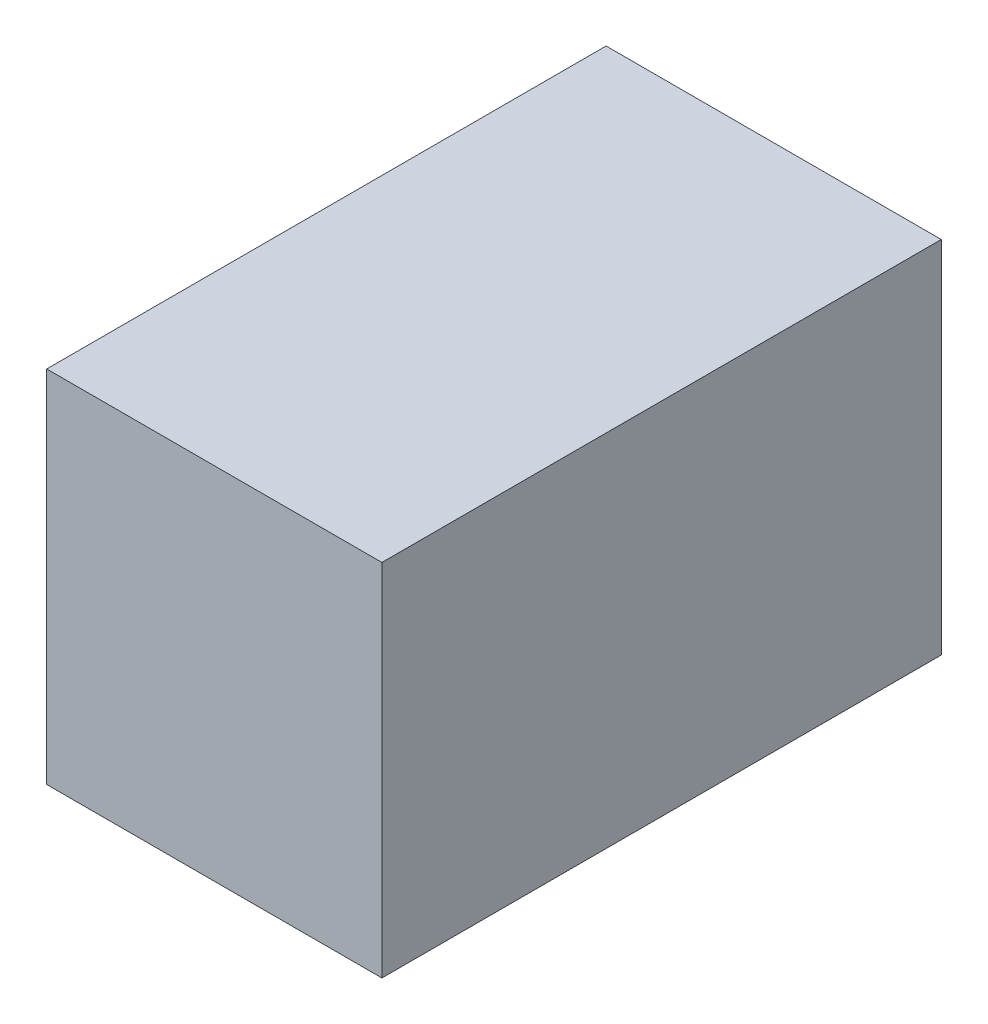
ISO-10303-21;
HEADER;
FILE_DESCRIPTION(('STEP AP214'),'2;1');
FILE_NAME('part.step','',(''),(''),'','','');
FILE_SCHEMA(('AUTOMOTIVE_DESIGN { 1 0 10303 214 1 1 1 1 }'));
ENDSEC;
DATA;
#1=APPLICATION_CONTEXT('core data for automotive mechanical design processes');
#2=APPLICATION_PROTOCOL_DEFINITION('international standard','automotive_design',2000,#1);
#3=PRODUCT_CONTEXT('',#1,'mechanical');
#4=PRODUCT('Part','Part','',(#3));
#5=PRODUCT_RELATED_PRODUCT_CATEGORY('part','',(#4));
#6=PRODUCT_DEFINITION_FORMATION('','',#4);
#7=PRODUCT_DEFINITION_CONTEXT('part definition',#1,'design');
#8=PRODUCT_DEFINITION('design','',#6,#7);
#9=PRODUCT_DEFINITION_SHAPE('','',#8);
#10=(LENGTH_UNIT() NAMED_UNIT(*) SI_UNIT(.MILLI.,.METRE.));
#11=(NAMED_UNIT(*) PLANE_ANGLE_UNIT() SI_UNIT($,.RADIAN.));
#12=(NAMED_UNIT(*) SI_UNIT($,.STERADIAN.) SOLID_ANGLE_UNIT());
#13=UNCERTAINTY_MEASURE_WITH_UNIT(LENGTH_MEASURE(1.E-05),#10,'distance_accuracy_value','');
#14=(GEOMETRIC_REPRESENTATION_CONTEXT(3) GLOBAL_UNCERTAINTY_ASSIGNED_CONTEXT((#13)) GLOBAL_UNIT_ASSIGNED_CONTEXT((#10,
#11,#12)) REPRESENTATION_CONTEXT('',''));
#15=CARTESIAN_POINT('',(0.,0.,0.));
#16=DIRECTION('',(0.,0.,1.));
#17=DIRECTION('',(1.,0.,0.));
#18=AXIS2_PLACEMENT_3D('',#15,#16,#17);
#19=CARTESIAN_POINT('',(19.,9.275,-17.525));
#20=DIRECTION('',(0.,0.,1.));
#21=DIRECTION('',(0.,-1.,0.));
#22=AXIS2_PLACEMENT_3D('',#19,#20,#21);
#23=PLANE('',#22);
#24=DIRECTION('',(0.,-1.,0.));
#25=VECTOR('',#24,1.);
#26=CARTESIAN_POINT('',(12.,9.27500000000001,-17.525));
#27=LINE('',#26,#25);
#28=CARTESIAN_POINT('',(12.,9.27500000000001,-17.525));
#29=VERTEX_POINT('',#28);
#30=CARTESIAN_POINT('',(12.,-9.275,-17.525));
#31=VERTEX_POINT('',#30);
#32=EDGE_CURVE('E202',#29,#31,#27,.T.);
#33=ORIENTED_EDGE('',*,*,#32,.F.);
#34=DIRECTION('',(1.,0.,0.));
#35=VECTOR('',#34,1.);
#36=CARTESIAN_POINT('',(0.,9.275,-17.525));
#37=LINE('',#36,#35);
#38=CARTESIAN_POINT('',(0.,9.275,-17.525));
#39=VERTEX_POINT('',#38);
#40=EDGE_CURVE('E206',#39,#29,#37,.T.);
#41=ORIENTED_EDGE('',*,*,#40,.F.);
#42=DIRECTION('',(0.,1.,0.));
#43=VECTOR('',#42,1.);
#44=CARTESIAN_POINT('',(0.,9.275,-17.525));
#45=LINE('',#44,#43);
#46=CARTESIAN_POINT('',(0.,11.275,-17.525));
#47=VERTEX_POINT('',#46);
#48=EDGE_CURVE('E92',#39,#47,#45,.T.);
#49=ORIENTED_EDGE('',*,*,#48,.T.);
#50=DIRECTION('',(-1.,0.,0.));
#51=VECTOR('',#50,1.);
#52=CARTESIAN_POINT('',(19.,11.275,-17.525));
#53=LINE('',#52,#51);
#54=CARTESIAN_POINT('',(21.,11.275,-17.525));
#55=VERTEX_POINT('',#54);
#56=EDGE_CURVE('E11',#55,#47,#53,.T.);
#57=ORIENTED_EDGE('',*,*,#56,.F.);
#58=DIRECTION('',(0.,1.,0.));
#59=VECTOR('',#58,1.);
#60=CARTESIAN_POINT('',(21.,9.275,-17.525));
#61=LINE('',#60,#59);
#62=CARTESIAN_POINT('',(21.,-11.275,-17.525));
#63=VERTEX_POINT('',#62);
#64=EDGE_CURVE('E120',#63,#55,#61,.T.);
#65=ORIENTED_EDGE('',*,*,#64,.F.);
#66=DIRECTION('',(-1.,0.,0.));
#67=VECTOR('',#66,1.);
#68=CARTESIAN_POINT('',(19.,-11.275,-17.525));
#69=LINE('',#68,#67);
#70=CARTESIAN_POINT('',(0.,-11.275,-17.525));
#71=VERTEX_POINT('',#70);
#72=EDGE_CURVE('E136',#63,#71,#69,.T.);
#73=ORIENTED_EDGE('',*,*,#72,.T.);
#74=CARTESIAN_POINT('',(0.,-9.275,-17.525));
#75=VERTEX_POINT('',#74);
#76=EDGE_CURVE('E140',#71,#75,#45,.T.);
#77=ORIENTED_EDGE('',*,*,#76,.T.);
#78=DIRECTION('',(-1.,0.,0.));
#79=VECTOR('',#78,1.);
#80=CARTESIAN_POINT('',(12.,-9.275,-17.525));
#81=LINE('',#80,#79);
#82=EDGE_CURVE('E198',#31,#75,#81,.T.);
#83=ORIENTED_EDGE('',*,*,#82,.F.);
#84=EDGE_LOOP('',(#33,#41,#49,#57,#65,#73,#77,#83));
#85=FACE_BOUND('',#84,.T.);
#86=ADVANCED_FACE('F43',(#85),#23,.F.);
#87=CARTESIAN_POINT('',(19.,11.275,15.525));
#88=DIRECTION('',(0.,-1.,0.));
#89=DIRECTION('',(0.,0.,-1.));
#90=AXIS2_PLACEMENT_3D('',#87,#88,#89);
#91=PLANE('',#90);
#92=DIRECTION('',(0.,0.,1.));
#93=VECTOR('',#92,1.);
#94=CARTESIAN_POINT('',(0.,11.275,15.525));
#95=LINE('',#94,#93);
#96=CARTESIAN_POINT('',(0.,11.275,17.525));
#97=VERTEX_POINT('',#96);
#98=EDGE_CURVE('E47',#47,#97,#95,.T.);
#99=ORIENTED_EDGE('',*,*,#98,.T.);
#100=DIRECTION('',(-1.,0.,0.));
#101=VECTOR('',#100,1.);
#102=CARTESIAN_POINT('',(19.,11.275,17.525));
#103=LINE('',#102,#101);
#104=CARTESIAN_POINT('',(21.,11.275,17.525));
#105=VERTEX_POINT('',#104);
#106=EDGE_CURVE('E53',#105,#97,#103,.T.);
#107=ORIENTED_EDGE('',*,*,#106,.F.);
#108=DIRECTION('',(0.,0.,1.));
#109=VECTOR('',#108,1.);
#110=CARTESIAN_POINT('',(21.,11.275,15.525));
#111=LINE('',#110,#109);
#112=EDGE_CURVE('E114',#55,#105,#111,.T.);
#113=ORIENTED_EDGE('',*,*,#112,.F.);
#114=ORIENTED_EDGE('',*,*,#56,.T.);
#115=EDGE_LOOP('',(#99,#107,#113,#114));
#116=FACE_BOUND('',#115,.T.);
#117=ADVANCED_FACE('F125',(#116),#91,.F.);
#118=CARTESIAN_POINT('',(19.,9.275,17.525));
#119=DIRECTION('',(0.,0.,-1.));
#120=DIRECTION('',(0.,1.,0.));
#121=AXIS2_PLACEMENT_3D('',#118,#119,#120);
#122=PLANE('',#121);
#123=DIRECTION('',(0.,-1.,0.));
#124=VECTOR('',#123,1.);
#125=CARTESIAN_POINT('',(0.,9.275,17.525));
#126=LINE('',#125,#124);
#127=CARTESIAN_POINT('',(0.,-11.275,17.525));
#128=VERTEX_POINT('',#127);
#129=EDGE_CURVE('E146',#97,#128,#126,.T.);
#130=ORIENTED_EDGE('',*,*,#129,.T.);
#131=DIRECTION('',(-1.,0.,0.));
#132=VECTOR('',#131,1.);
#133=CARTESIAN_POINT('',(19.,-11.275,17.525));
#134=LINE('',#133,#132);
#135=CARTESIAN_POINT('',(21.,-11.275,17.525));
#136=VERTEX_POINT('',#135);
#137=EDGE_CURVE('E129',#136,#128,#134,.T.);
#138=ORIENTED_EDGE('',*,*,#137,.F.);
#139=DIRECTION('',(0.,-1.,0.));
#140=VECTOR('',#139,1.);
#141=CARTESIAN_POINT('',(21.,9.275,17.525));
#142=LINE('',#141,#140);
#143=EDGE_CURVE('E117',#105,#136,#142,.T.);
#144=ORIENTED_EDGE('',*,*,#143,.F.);
#145=ORIENTED_EDGE('',*,*,#106,.T.);
#146=EDGE_LOOP('',(#130,#138,#144,#145));
#147=FACE_BOUND('',#146,.T.);
#148=ADVANCED_FACE('F131',(#147),#122,.F.);
#149=CARTESIAN_POINT('',(19.,-11.275,15.525));
#150=DIRECTION('',(0.,1.,0.));
#151=DIRECTION('',(0.,0.,1.));
#152=AXIS2_PLACEMENT_3D('',#149,#150,#151);
#153=PLANE('',#152);
#154=DIRECTION('',(0.,0.,-1.));
#155=VECTOR('',#154,1.);
#156=CARTESIAN_POINT('',(0.,-11.275,15.525));
#157=LINE('',#156,#155);
#158=EDGE_CURVE('E144',#128,#71,#157,.T.);
#159=ORIENTED_EDGE('',*,*,#158,.T.);
#160=ORIENTED_EDGE('',*,*,#72,.F.);
#161=DIRECTION('',(0.,0.,-1.));
#162=VECTOR('',#161,1.);
#163=CARTESIAN_POINT('',(21.,-11.275,15.525));
#164=LINE('',#163,#162);
#165=EDGE_CURVE('E70',#136,#63,#164,.T.);
#166=ORIENTED_EDGE('',*,*,#165,.F.);
#167=ORIENTED_EDGE('',*,*,#137,.T.);
#168=EDGE_LOOP('',(#159,#160,#166,#167));
#169=FACE_BOUND('',#168,.T.);
#170=ADVANCED_FACE('F224',(#169),#153,.F.);
#171=CARTESIAN_POINT('',(21.,0.,0.));
#172=DIRECTION('',(1.,0.,0.));
#173=DIRECTION('',(0.,0.,-1.));
#174=AXIS2_PLACEMENT_3D('',#171,#172,#173);
#175=PLANE('',#174);
#176=ORIENTED_EDGE('',*,*,#64,.T.);
#177=ORIENTED_EDGE('',*,*,#112,.T.);
#178=ORIENTED_EDGE('',*,*,#143,.T.);
#179=ORIENTED_EDGE('',*,*,#165,.T.);
#180=EDGE_LOOP('',(#176,#177,#178,#179));
#181=FACE_BOUND('',#180,.T.);
#182=ADVANCED_FACE('F45',(#181),#175,.T.);
#183=CARTESIAN_POINT('',(0.,0.,0.));
#184=DIRECTION('',(1.,0.,0.));
#185=DIRECTION('',(0.,0.,-1.));
#186=AXIS2_PLACEMENT_3D('',#183,#184,#185);
#187=PLANE('',#186);
#188=ORIENTED_EDGE('',*,*,#48,.F.);
#189=DIRECTION('',(0.,0.,1.));
#190=VECTOR('',#189,1.);
#191=CARTESIAN_POINT('',(0.,9.275,15.525));
#192=LINE('',#191,#190);
#193=CARTESIAN_POINT('',(0.,9.275,15.525));
#194=VERTEX_POINT('',#193);
#195=EDGE_CURVE('E182',#39,#194,#192,.T.);
#196=ORIENTED_EDGE('',*,*,#195,.T.);
#197=DIRECTION('',(0.,-1.,0.));
#198=VECTOR('',#197,1.);
#199=CARTESIAN_POINT('',(0.,9.275,15.525));
#200=LINE('',#199,#198);
#201=CARTESIAN_POINT('',(0.,-9.275,15.525));
#202=VERTEX_POINT('',#201);
#203=EDGE_CURVE('E61',#194,#202,#200,.T.);
#204=ORIENTED_EDGE('',*,*,#203,.T.);
#205=DIRECTION('',(0.,0.,-1.));
#206=VECTOR('',#205,1.);
#207=CARTESIAN_POINT('',(0.,-9.275,15.525));
#208=LINE('',#207,#206);
#209=EDGE_CURVE('E176',#202,#75,#208,.T.);
#210=ORIENTED_EDGE('',*,*,#209,.T.);
#211=ORIENTED_EDGE('',*,*,#76,.F.);
#212=ORIENTED_EDGE('',*,*,#158,.F.);
#213=ORIENTED_EDGE('',*,*,#129,.F.);
#214=ORIENTED_EDGE('',*,*,#98,.F.);
#215=EDGE_LOOP('',(#188,#196,#204,#210,#211,#212,#213,#214));
#216=FACE_BOUND('',#215,.T.);
#217=ADVANCED_FACE('F226',(#216),#187,.F.);
#218=CARTESIAN_POINT('',(19.,9.275,-15.525));
#219=DIRECTION('',(0.,0.,1.));
#220=DIRECTION('',(0.,-1.,0.));
#221=AXIS2_PLACEMENT_3D('',#218,#219,#220);
#222=PLANE('',#221);
#223=DIRECTION('',(0.,-1.,0.));
#224=VECTOR('',#223,1.);
#225=CARTESIAN_POINT('',(12.,9.27500000000001,-15.525));
#226=LINE('',#225,#224);
#227=CARTESIAN_POINT('',(12.,9.27500000000001,-15.525));
#228=VERTEX_POINT('',#227);
#229=CARTESIAN_POINT('',(12.,-9.275,-15.525));
#230=VERTEX_POINT('',#229);
#231=EDGE_CURVE('E190',#228,#230,#226,.T.);
#232=ORIENTED_EDGE('',*,*,#231,.T.);
#233=DIRECTION('',(-1.,0.,0.));
#234=VECTOR('',#233,1.);
#235=CARTESIAN_POINT('',(19.,-9.275,-15.525));
#236=LINE('',#235,#234);
#237=CARTESIAN_POINT('',(19.,-9.275,-15.525));
#238=VERTEX_POINT('',#237);
#239=EDGE_CURVE('E160',#238,#230,#236,.T.);
#240=ORIENTED_EDGE('',*,*,#239,.F.);
#241=DIRECTION('',(0.,1.,0.));
#242=VECTOR('',#241,1.);
#243=CARTESIAN_POINT('',(19.,9.275,-15.525));
#244=LINE('',#243,#242);
#245=CARTESIAN_POINT('',(19.,9.275,-15.525));
#246=VERTEX_POINT('',#245);
#247=EDGE_CURVE('E172',#238,#246,#244,.T.);
#248=ORIENTED_EDGE('',*,*,#247,.T.);
#249=DIRECTION('',(-1.,0.,0.));
#250=VECTOR('',#249,1.);
#251=CARTESIAN_POINT('',(19.,9.275,-15.525));
#252=LINE('',#251,#250);
#253=EDGE_CURVE('E151',#246,#228,#252,.T.);
#254=ORIENTED_EDGE('',*,*,#253,.T.);
#255=EDGE_LOOP('',(#232,#240,#248,#254));
#256=FACE_BOUND('',#255,.T.);
#257=ADVANCED_FACE('F250',(#256),#222,.T.);
#258=CARTESIAN_POINT('',(19.,9.275,15.525));
#259=DIRECTION('',(0.,-1.,0.));
#260=DIRECTION('',(0.,0.,-1.));
#261=AXIS2_PLACEMENT_3D('',#258,#259,#260);
#262=PLANE('',#261);
#263=ORIENTED_EDGE('',*,*,#195,.F.);
#264=ORIENTED_EDGE('',*,*,#40,.T.);
#265=DIRECTION('',(0.,0.,-1.));
#266=VECTOR('',#265,1.);
#267=CARTESIAN_POINT('',(12.,9.275,6.56804189105701));
#268=LINE('',#267,#266);
#269=EDGE_CURVE('E194',#228,#29,#268,.T.);
#270=ORIENTED_EDGE('',*,*,#269,.F.);
#271=ORIENTED_EDGE('',*,*,#253,.F.);
#272=DIRECTION('',(0.,0.,1.));
#273=VECTOR('',#272,1.);
#274=CARTESIAN_POINT('',(19.,9.275,15.525));
#275=LINE('',#274,#273);
#276=CARTESIAN_POINT('',(19.,9.275,15.525));
#277=VERTEX_POINT('',#276);
#278=EDGE_CURVE('E168',#246,#277,#275,.T.);
#279=ORIENTED_EDGE('',*,*,#278,.T.);
#280=DIRECTION('',(-1.,0.,0.));
#281=VECTOR('',#280,1.);
#282=CARTESIAN_POINT('',(19.,9.275,15.525));
#283=LINE('',#282,#281);
#284=EDGE_CURVE('E154',#277,#194,#283,.T.);
#285=ORIENTED_EDGE('',*,*,#284,.T.);
#286=EDGE_LOOP('',(#263,#264,#270,#271,#279,#285));
#287=FACE_BOUND('',#286,.T.);
#288=ADVANCED_FACE('F243',(#287),#262,.T.);
#289=CARTESIAN_POINT('',(19.,9.275,15.525));
#290=DIRECTION('',(0.,0.,-1.));
#291=DIRECTION('',(0.,1.,0.));
#292=AXIS2_PLACEMENT_3D('',#289,#290,#291);
#293=PLANE('',#292);
#294=ORIENTED_EDGE('',*,*,#203,.F.);
#295=ORIENTED_EDGE('',*,*,#284,.F.);
#296=DIRECTION('',(0.,-1.,0.));
#297=VECTOR('',#296,1.);
#298=CARTESIAN_POINT('',(19.,9.275,15.525));
#299=LINE('',#298,#297);
#300=CARTESIAN_POINT('',(19.,-9.275,15.525));
#301=VERTEX_POINT('',#300);
#302=EDGE_CURVE('E165',#277,#301,#299,.T.);
#303=ORIENTED_EDGE('',*,*,#302,.T.);
#304=DIRECTION('',(-1.,0.,0.));
#305=VECTOR('',#304,1.);
#306=CARTESIAN_POINT('',(19.,-9.275,15.525));
#307=LINE('',#306,#305);
#308=EDGE_CURVE('E157',#301,#202,#307,.T.);
#309=ORIENTED_EDGE('',*,*,#308,.T.);
#310=EDGE_LOOP('',(#294,#295,#303,#309));
#311=FACE_BOUND('',#310,.T.);
#312=ADVANCED_FACE('F247',(#311),#293,.T.);
#313=CARTESIAN_POINT('',(19.,-9.275,15.525));
#314=DIRECTION('',(0.,1.,0.));
#315=DIRECTION('',(0.,0.,1.));
#316=AXIS2_PLACEMENT_3D('',#313,#314,#315);
#317=PLANE('',#316);
#318=ORIENTED_EDGE('',*,*,#209,.F.);
#319=ORIENTED_EDGE('',*,*,#308,.F.);
#320=DIRECTION('',(0.,0.,-1.));
#321=VECTOR('',#320,1.);
#322=CARTESIAN_POINT('',(19.,-9.275,15.525));
#323=LINE('',#322,#321);
#324=EDGE_CURVE('E101',#301,#238,#323,.T.);
#325=ORIENTED_EDGE('',*,*,#324,.T.);
#326=ORIENTED_EDGE('',*,*,#239,.T.);
#327=DIRECTION('',(0.,0.,-1.));
#328=VECTOR('',#327,1.);
#329=CARTESIAN_POINT('',(12.,-9.275,6.56804189105701));
#330=LINE('',#329,#328);
#331=EDGE_CURVE('E186',#230,#31,#330,.T.);
#332=ORIENTED_EDGE('',*,*,#331,.T.);
#333=ORIENTED_EDGE('',*,*,#82,.T.);
#334=EDGE_LOOP('',(#318,#319,#325,#326,#332,#333));
#335=FACE_BOUND('',#334,.T.);
#336=ADVANCED_FACE('F252',(#335),#317,.T.);
#337=CARTESIAN_POINT('',(19.,0.,0.));
#338=DIRECTION('',(1.,0.,0.));
#339=DIRECTION('',(0.,0.,-1.));
#340=AXIS2_PLACEMENT_3D('',#337,#338,#339);
#341=PLANE('',#340);
#342=ORIENTED_EDGE('',*,*,#247,.F.);
#343=ORIENTED_EDGE('',*,*,#324,.F.);
#344=ORIENTED_EDGE('',*,*,#302,.F.);
#345=ORIENTED_EDGE('',*,*,#278,.F.);
#346=EDGE_LOOP('',(#342,#343,#344,#345));
#347=FACE_BOUND('',#346,.T.);
#348=ADVANCED_FACE('F248',(#347),#341,.F.);
#349=CARTESIAN_POINT('',(12.,9.275,6.56804189105701));
#350=DIRECTION('',(1.,0.,0.));
#351=DIRECTION('',(0.,1.,0.));
#352=AXIS2_PLACEMENT_3D('',#349,#350,#351);
#353=PLANE('',#352);
#354=ORIENTED_EDGE('',*,*,#269,.T.);
#355=ORIENTED_EDGE('',*,*,#32,.T.);
#356=ORIENTED_EDGE('',*,*,#331,.F.);
#357=ORIENTED_EDGE('',*,*,#231,.F.);
#358=EDGE_LOOP('',(#354,#355,#356,#357));
#359=FACE_BOUND('',#358,.T.);
#360=ADVANCED_FACE('F254',(#359),#353,.F.);
#361=CLOSED_SHELL('',(#86,#117,#148,#170,#182,#217,#257,#288,#312,#336,#348,#360));
#362=MANIFOLD_SOLID_BREP('B2',#361);
#363=ADVANCED_BREP_SHAPE_REPRESENTATION('',(#18,#362),#14);
#364=SHAPE_DEFINITION_REPRESENTATION(#9,#363);
ENDSEC;
END-ISO-10303-21;
